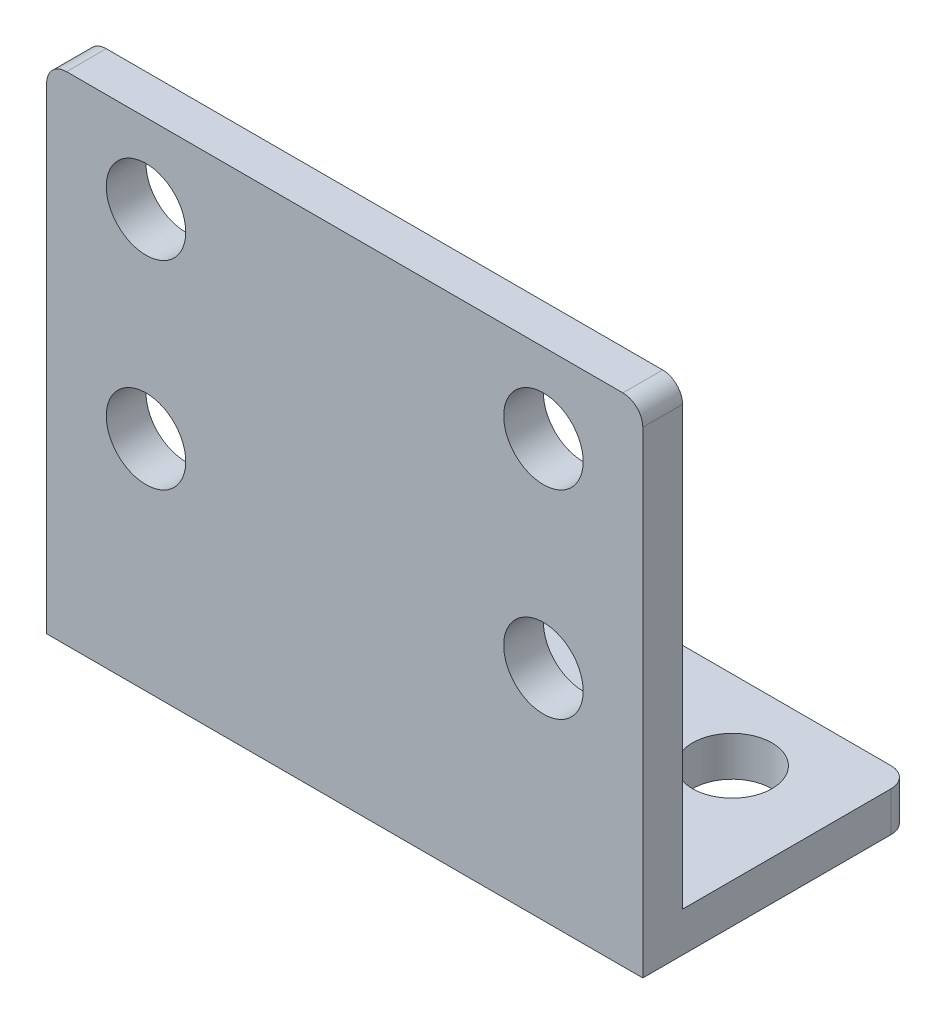
ISO-10303-21;
HEADER;
FILE_DESCRIPTION(('STEP AP214'),'2;1');
FILE_NAME('part.step','',(''),(''),'','','');
FILE_SCHEMA(('AUTOMOTIVE_DESIGN { 1 0 10303 214 1 1 1 1 }'));
ENDSEC;
DATA;
#1=APPLICATION_CONTEXT('core data for automotive mechanical design processes');
#2=APPLICATION_PROTOCOL_DEFINITION('international standard','automotive_design',2000,#1);
#3=PRODUCT_CONTEXT('',#1,'mechanical');
#4=PRODUCT('Part','Part','',(#3));
#5=PRODUCT_RELATED_PRODUCT_CATEGORY('part','',(#4));
#6=PRODUCT_DEFINITION_FORMATION('','',#4);
#7=PRODUCT_DEFINITION_CONTEXT('part definition',#1,'design');
#8=PRODUCT_DEFINITION('design','',#6,#7);
#9=PRODUCT_DEFINITION_SHAPE('','',#8);
#10=(LENGTH_UNIT() NAMED_UNIT(*) SI_UNIT(.MILLI.,.METRE.));
#11=(NAMED_UNIT(*) PLANE_ANGLE_UNIT() SI_UNIT($,.RADIAN.));
#12=(NAMED_UNIT(*) SI_UNIT($,.STERADIAN.) SOLID_ANGLE_UNIT());
#13=UNCERTAINTY_MEASURE_WITH_UNIT(LENGTH_MEASURE(1.E-05),#10,'distance_accuracy_value','');
#14=(GEOMETRIC_REPRESENTATION_CONTEXT(3) GLOBAL_UNCERTAINTY_ASSIGNED_CONTEXT((#13)) GLOBAL_UNIT_ASSIGNED_CONTEXT((#10,
#11,#12)) REPRESENTATION_CONTEXT('',''));
#15=CARTESIAN_POINT('',(0.,0.,0.));
#16=DIRECTION('',(0.,0.,1.));
#17=DIRECTION('',(1.,0.,0.));
#18=AXIS2_PLACEMENT_3D('',#15,#16,#17);
#19=CARTESIAN_POINT('',(60.,0.,-27.));
#20=DIRECTION('',(0.,1.,0.));
#21=DIRECTION('',(0.,0.,1.));
#22=AXIS2_PLACEMENT_3D('',#19,#20,#21);
#23=PLANE('',#22);
#24=CARTESIAN_POINT('',(10.,0.,-19.));
#25=DIRECTION('',(0.,-1.,0.));
#26=DIRECTION('',(0.,0.,-1.));
#27=AXIS2_PLACEMENT_3D('',#24,#25,#26);
#28=CIRCLE('',#27,4.00000000294392);
#29=CARTESIAN_POINT('',(10.,0.,-23.0000000029439));
#30=VERTEX_POINT('',#29);
#31=EDGE_CURVE('E238',#30,#30,#28,.T.);
#32=ORIENTED_EDGE('',*,*,#31,.F.);
#33=EDGE_LOOP('',(#32));
#34=FACE_BOUND('',#33,.T.);
#35=CARTESIAN_POINT('',(50.,0.,-19.));
#36=DIRECTION('',(0.,-1.,0.));
#37=DIRECTION('',(0.,0.,-1.));
#38=AXIS2_PLACEMENT_3D('',#35,#36,#37);
#39=CIRCLE('',#38,4.00000000294394);
#40=CARTESIAN_POINT('',(50.,0.,-23.0000000029439));
#41=VERTEX_POINT('',#40);
#42=EDGE_CURVE('E232',#41,#41,#39,.T.);
#43=ORIENTED_EDGE('',*,*,#42,.F.);
#44=EDGE_LOOP('',(#43));
#45=FACE_BOUND('',#44,.T.);
#46=DIRECTION('',(-1.,0.,0.));
#47=VECTOR('',#46,1.);
#48=CARTESIAN_POINT('',(60.,0.,-27.));
#49=LINE('',#48,#47);
#50=CARTESIAN_POINT('',(58.,0.,-27.));
#51=VERTEX_POINT('',#50);
#52=CARTESIAN_POINT('',(2.,0.,-27.));
#53=VERTEX_POINT('',#52);
#54=EDGE_CURVE('E160',#51,#53,#49,.T.);
#55=ORIENTED_EDGE('',*,*,#54,.F.);
#56=CARTESIAN_POINT('',(58.,0.,-25.));
#57=DIRECTION('',(0.,1.,0.));
#58=DIRECTION('',(0.,0.,1.));
#59=AXIS2_PLACEMENT_3D('',#56,#57,#58);
#60=CIRCLE('',#59,2.);
#61=CARTESIAN_POINT('',(60.,0.,-25.));
#62=VERTEX_POINT('',#61);
#63=EDGE_CURVE('E177',#51,#62,#60,.F.);
#64=ORIENTED_EDGE('',*,*,#63,.T.);
#65=DIRECTION('',(0.,0.,-1.));
#66=VECTOR('',#65,1.);
#67=CARTESIAN_POINT('',(60.,0.,-27.));
#68=LINE('',#67,#66);
#69=CARTESIAN_POINT('',(60.,0.,0.));
#70=VERTEX_POINT('',#69);
#71=EDGE_CURVE('E124',#70,#62,#68,.T.);
#72=ORIENTED_EDGE('',*,*,#71,.F.);
#73=DIRECTION('',(-1.,0.,0.));
#74=VECTOR('',#73,1.);
#75=CARTESIAN_POINT('',(60.,0.,0.));
#76=LINE('',#75,#74);
#77=CARTESIAN_POINT('',(0.,0.,0.));
#78=VERTEX_POINT('',#77);
#79=EDGE_CURVE('E139',#70,#78,#76,.T.);
#80=ORIENTED_EDGE('',*,*,#79,.T.);
#81=DIRECTION('',(0.,0.,-1.));
#82=VECTOR('',#81,1.);
#83=CARTESIAN_POINT('',(0.,0.,-27.));
#84=LINE('',#83,#82);
#85=CARTESIAN_POINT('',(0.,0.,-25.));
#86=VERTEX_POINT('',#85);
#87=EDGE_CURVE('E143',#78,#86,#84,.T.);
#88=ORIENTED_EDGE('',*,*,#87,.T.);
#89=CARTESIAN_POINT('',(2.,0.,-25.));
#90=DIRECTION('',(0.,1.,0.));
#91=DIRECTION('',(0.,0.,1.));
#92=AXIS2_PLACEMENT_3D('',#89,#90,#91);
#93=CIRCLE('',#92,2.);
#94=EDGE_CURVE('E175',#86,#53,#93,.F.);
#95=ORIENTED_EDGE('',*,*,#94,.T.);
#96=EDGE_LOOP('',(#55,#64,#72,#80,#88,#95));
#97=FACE_BOUND('',#96,.T.);
#98=ADVANCED_FACE('F35',(#34,#45,#97),#23,.F.);
#99=CARTESIAN_POINT('',(60.,4.,-27.));
#100=DIRECTION('',(0.,0.,1.));
#101=DIRECTION('',(1.,0.,0.));
#102=AXIS2_PLACEMENT_3D('',#99,#100,#101);
#103=PLANE('',#102);
#104=DIRECTION('',(-1.,0.,0.));
#105=VECTOR('',#104,1.);
#106=CARTESIAN_POINT('',(60.,4.,-27.));
#107=LINE('',#106,#105);
#108=CARTESIAN_POINT('',(58.,4.,-27.));
#109=VERTEX_POINT('',#108);
#110=CARTESIAN_POINT('',(2.,4.,-27.));
#111=VERTEX_POINT('',#110);
#112=EDGE_CURVE('E132',#109,#111,#107,.T.);
#113=ORIENTED_EDGE('',*,*,#112,.F.);
#114=DIRECTION('',(0.,1.,0.));
#115=VECTOR('',#114,1.);
#116=CARTESIAN_POINT('',(58.,4.,-27.));
#117=LINE('',#116,#115);
#118=EDGE_CURVE('E173',#109,#51,#117,.F.);
#119=ORIENTED_EDGE('',*,*,#118,.T.);
#120=ORIENTED_EDGE('',*,*,#54,.T.);
#121=DIRECTION('',(0.,1.,0.));
#122=VECTOR('',#121,1.);
#123=CARTESIAN_POINT('',(2.,4.,-27.));
#124=LINE('',#123,#122);
#125=EDGE_CURVE('E170',#53,#111,#124,.T.);
#126=ORIENTED_EDGE('',*,*,#125,.T.);
#127=EDGE_LOOP('',(#113,#119,#120,#126));
#128=FACE_BOUND('',#127,.T.);
#129=ADVANCED_FACE('F247',(#128),#103,.F.);
#130=CARTESIAN_POINT('',(60.,4.,-4.00000000000001));
#131=DIRECTION('',(0.,-1.,0.));
#132=DIRECTION('',(0.,0.,-1.));
#133=AXIS2_PLACEMENT_3D('',#130,#131,#132);
#134=PLANE('',#133);
#135=CARTESIAN_POINT('',(10.,4.,-19.));
#136=DIRECTION('',(0.,-1.,0.));
#137=DIRECTION('',(0.,0.,-1.));
#138=AXIS2_PLACEMENT_3D('',#135,#136,#137);
#139=CIRCLE('',#138,4.00000000294392);
#140=CARTESIAN_POINT('',(10.,4.,-23.0000000029439));
#141=VERTEX_POINT('',#140);
#142=EDGE_CURVE('E235',#141,#141,#139,.F.);
#143=ORIENTED_EDGE('',*,*,#142,.F.);
#144=EDGE_LOOP('',(#143));
#145=FACE_BOUND('',#144,.T.);
#146=CARTESIAN_POINT('',(50.,4.,-19.));
#147=DIRECTION('',(0.,-1.,0.));
#148=DIRECTION('',(0.,0.,-1.));
#149=AXIS2_PLACEMENT_3D('',#146,#147,#148);
#150=CIRCLE('',#149,4.00000000294394);
#151=CARTESIAN_POINT('',(50.,4.,-23.0000000029439));
#152=VERTEX_POINT('',#151);
#153=EDGE_CURVE('E219',#152,#152,#150,.F.);
#154=ORIENTED_EDGE('',*,*,#153,.F.);
#155=EDGE_LOOP('',(#154));
#156=FACE_BOUND('',#155,.T.);
#157=DIRECTION('',(0.,0.,1.));
#158=VECTOR('',#157,1.);
#159=CARTESIAN_POINT('',(60.,4.,-4.00000000000001));
#160=LINE('',#159,#158);
#161=CARTESIAN_POINT('',(60.,4.,-25.));
#162=VERTEX_POINT('',#161);
#163=CARTESIAN_POINT('',(60.,4.,-4.00000000000001));
#164=VERTEX_POINT('',#163);
#165=EDGE_CURVE('E113',#162,#164,#160,.T.);
#166=ORIENTED_EDGE('',*,*,#165,.F.);
#167=CARTESIAN_POINT('',(58.,4.,-25.));
#168=DIRECTION('',(0.,-1.,0.));
#169=DIRECTION('',(0.,0.,-1.));
#170=AXIS2_PLACEMENT_3D('',#167,#168,#169);
#171=CIRCLE('',#170,2.);
#172=EDGE_CURVE('E168',#162,#109,#171,.F.);
#173=ORIENTED_EDGE('',*,*,#172,.T.);
#174=ORIENTED_EDGE('',*,*,#112,.T.);
#175=CARTESIAN_POINT('',(2.,4.,-25.));
#176=DIRECTION('',(0.,-1.,0.));
#177=DIRECTION('',(0.,0.,-1.));
#178=AXIS2_PLACEMENT_3D('',#175,#176,#177);
#179=CIRCLE('',#178,2.);
#180=CARTESIAN_POINT('',(0.,4.,-25.));
#181=VERTEX_POINT('',#180);
#182=EDGE_CURVE('E166',#111,#181,#179,.F.);
#183=ORIENTED_EDGE('',*,*,#182,.T.);
#184=DIRECTION('',(0.,0.,1.));
#185=VECTOR('',#184,1.);
#186=CARTESIAN_POINT('',(0.,4.,-4.00000000000001));
#187=LINE('',#186,#185);
#188=CARTESIAN_POINT('',(0.,4.,-4.00000000000001));
#189=VERTEX_POINT('',#188);
#190=EDGE_CURVE('E130',#181,#189,#187,.T.);
#191=ORIENTED_EDGE('',*,*,#190,.T.);
#192=DIRECTION('',(-1.,0.,0.));
#193=VECTOR('',#192,1.);
#194=CARTESIAN_POINT('',(60.,4.,-4.00000000000001));
#195=LINE('',#194,#193);
#196=EDGE_CURVE('E127',#164,#189,#195,.T.);
#197=ORIENTED_EDGE('',*,*,#196,.F.);
#198=EDGE_LOOP('',(#166,#173,#174,#183,#191,#197));
#199=FACE_BOUND('',#198,.T.);
#200=ADVANCED_FACE('F128',(#145,#156,#199),#134,.F.);
#201=CARTESIAN_POINT('',(60.,50.,-4.));
#202=DIRECTION('',(0.,0.,1.));
#203=DIRECTION('',(0.,-1.,0.));
#204=AXIS2_PLACEMENT_3D('',#201,#202,#203);
#205=PLANE('',#204);
#206=CARTESIAN_POINT('',(50.,22.,-4.));
#207=DIRECTION('',(0.,0.,1.));
#208=DIRECTION('',(0.,-1.,0.));
#209=AXIS2_PLACEMENT_3D('',#206,#207,#208);
#210=CIRCLE('',#209,3.99999999629061);
#211=CARTESIAN_POINT('',(50.,18.0000000037094,-4.));
#212=VERTEX_POINT('',#211);
#213=EDGE_CURVE('E211',#212,#212,#210,.F.);
#214=ORIENTED_EDGE('',*,*,#213,.F.);
#215=EDGE_LOOP('',(#214));
#216=FACE_BOUND('',#215,.T.);
#217=CARTESIAN_POINT('',(50.,42.,-4.));
#218=DIRECTION('',(0.,0.,1.));
#219=DIRECTION('',(0.,-1.,0.));
#220=AXIS2_PLACEMENT_3D('',#217,#218,#219);
#221=CIRCLE('',#220,3.9999999962906);
#222=CARTESIAN_POINT('',(50.,38.0000000037094,-4.));
#223=VERTEX_POINT('',#222);
#224=EDGE_CURVE('E220',#223,#223,#221,.F.);
#225=ORIENTED_EDGE('',*,*,#224,.F.);
#226=EDGE_LOOP('',(#225));
#227=FACE_BOUND('',#226,.T.);
#228=CARTESIAN_POINT('',(10.,42.,-4.));
#229=DIRECTION('',(0.,0.,1.));
#230=DIRECTION('',(0.,-1.,0.));
#231=AXIS2_PLACEMENT_3D('',#228,#229,#230);
#232=CIRCLE('',#231,3.9999999962906);
#233=CARTESIAN_POINT('',(10.,38.0000000037094,-4.));
#234=VERTEX_POINT('',#233);
#235=EDGE_CURVE('E212',#234,#234,#232,.F.);
#236=ORIENTED_EDGE('',*,*,#235,.F.);
#237=EDGE_LOOP('',(#236));
#238=FACE_BOUND('',#237,.T.);
#239=CARTESIAN_POINT('',(10.,22.,-4.));
#240=DIRECTION('',(0.,0.,1.));
#241=DIRECTION('',(0.,-1.,0.));
#242=AXIS2_PLACEMENT_3D('',#239,#240,#241);
#243=CIRCLE('',#242,3.99999999629061);
#244=CARTESIAN_POINT('',(10.,18.0000000037094,-4.));
#245=VERTEX_POINT('',#244);
#246=EDGE_CURVE('E146',#245,#245,#243,.F.);
#247=ORIENTED_EDGE('',*,*,#246,.F.);
#248=EDGE_LOOP('',(#247));
#249=FACE_BOUND('',#248,.T.);
#250=DIRECTION('',(-1.,0.,0.));
#251=VECTOR('',#250,1.);
#252=CARTESIAN_POINT('',(60.,50.,-4.));
#253=LINE('',#252,#251);
#254=CARTESIAN_POINT('',(58.,50.,-4.));
#255=VERTEX_POINT('',#254);
#256=CARTESIAN_POINT('',(2.,50.,-4.));
#257=VERTEX_POINT('',#256);
#258=EDGE_CURVE('E133',#255,#257,#253,.T.);
#259=ORIENTED_EDGE('',*,*,#258,.F.);
#260=CARTESIAN_POINT('',(58.,48.,-4.));
#261=DIRECTION('',(0.,0.,1.));
#262=DIRECTION('',(0.,-1.,0.));
#263=AXIS2_PLACEMENT_3D('',#260,#261,#262);
#264=CIRCLE('',#263,2.);
#265=CARTESIAN_POINT('',(60.,48.,-4.));
#266=VERTEX_POINT('',#265);
#267=EDGE_CURVE('E11',#255,#266,#264,.F.);
#268=ORIENTED_EDGE('',*,*,#267,.T.);
#269=DIRECTION('',(0.,1.,0.));
#270=VECTOR('',#269,1.);
#271=CARTESIAN_POINT('',(60.,50.,-4.));
#272=LINE('',#271,#270);
#273=EDGE_CURVE('E119',#164,#266,#272,.T.);
#274=ORIENTED_EDGE('',*,*,#273,.F.);
#275=ORIENTED_EDGE('',*,*,#196,.T.);
#276=DIRECTION('',(0.,1.,0.));
#277=VECTOR('',#276,1.);
#278=CARTESIAN_POINT('',(0.,50.,-4.));
#279=LINE('',#278,#277);
#280=CARTESIAN_POINT('',(0.,48.,-4.));
#281=VERTEX_POINT('',#280);
#282=EDGE_CURVE('E148',#189,#281,#279,.T.);
#283=ORIENTED_EDGE('',*,*,#282,.T.);
#284=CARTESIAN_POINT('',(2.,48.,-4.));
#285=DIRECTION('',(0.,0.,1.));
#286=DIRECTION('',(0.,-1.,0.));
#287=AXIS2_PLACEMENT_3D('',#284,#285,#286);
#288=CIRCLE('',#287,2.);
#289=EDGE_CURVE('E43',#281,#257,#288,.F.);
#290=ORIENTED_EDGE('',*,*,#289,.T.);
#291=EDGE_LOOP('',(#259,#268,#274,#275,#283,#290));
#292=FACE_BOUND('',#291,.T.);
#293=ADVANCED_FACE('F135',(#216,#227,#238,#249,#292),#205,.F.);
#294=CARTESIAN_POINT('',(60.,50.,0.));
#295=DIRECTION('',(0.,-1.,0.));
#296=DIRECTION('',(0.,0.,-1.));
#297=AXIS2_PLACEMENT_3D('',#294,#295,#296);
#298=PLANE('',#297);
#299=DIRECTION('',(-1.,0.,0.));
#300=VECTOR('',#299,1.);
#301=CARTESIAN_POINT('',(60.,50.,0.));
#302=LINE('',#301,#300);
#303=CARTESIAN_POINT('',(58.,50.,0.));
#304=VERTEX_POINT('',#303);
#305=CARTESIAN_POINT('',(2.,50.,0.));
#306=VERTEX_POINT('',#305);
#307=EDGE_CURVE('E154',#304,#306,#302,.T.);
#308=ORIENTED_EDGE('',*,*,#307,.F.);
#309=DIRECTION('',(0.,0.,1.));
#310=VECTOR('',#309,1.);
#311=CARTESIAN_POINT('',(58.,50.,0.));
#312=LINE('',#311,#310);
#313=EDGE_CURVE('E56',#304,#255,#312,.F.);
#314=ORIENTED_EDGE('',*,*,#313,.T.);
#315=ORIENTED_EDGE('',*,*,#258,.T.);
#316=DIRECTION('',(0.,0.,1.));
#317=VECTOR('',#316,1.);
#318=CARTESIAN_POINT('',(2.,50.,0.));
#319=LINE('',#318,#317);
#320=EDGE_CURVE('E187',#257,#306,#319,.T.);
#321=ORIENTED_EDGE('',*,*,#320,.T.);
#322=EDGE_LOOP('',(#308,#314,#315,#321));
#323=FACE_BOUND('',#322,.T.);
#324=ADVANCED_FACE('F191',(#323),#298,.F.);
#325=CARTESIAN_POINT('',(60.,0.,0.));
#326=DIRECTION('',(0.,0.,-1.));
#327=DIRECTION('',(-1.,0.,0.));
#328=AXIS2_PLACEMENT_3D('',#325,#326,#327);
#329=PLANE('',#328);
#330=CARTESIAN_POINT('',(50.,22.,0.));
#331=DIRECTION('',(0.,0.,1.));
#332=DIRECTION('',(1.,0.,0.));
#333=AXIS2_PLACEMENT_3D('',#330,#331,#332);
#334=CIRCLE('',#333,3.99999999629061);
#335=CARTESIAN_POINT('',(53.9999999962906,22.,0.));
#336=VERTEX_POINT('',#335);
#337=EDGE_CURVE('E223',#336,#336,#334,.T.);
#338=ORIENTED_EDGE('',*,*,#337,.F.);
#339=EDGE_LOOP('',(#338));
#340=FACE_BOUND('',#339,.T.);
#341=CARTESIAN_POINT('',(50.,42.,0.));
#342=DIRECTION('',(0.,0.,1.));
#343=DIRECTION('',(1.,0.,0.));
#344=AXIS2_PLACEMENT_3D('',#341,#342,#343);
#345=CIRCLE('',#344,3.9999999962906);
#346=CARTESIAN_POINT('',(53.9999999962906,42.,0.));
#347=VERTEX_POINT('',#346);
#348=EDGE_CURVE('E215',#347,#347,#345,.T.);
#349=ORIENTED_EDGE('',*,*,#348,.F.);
#350=EDGE_LOOP('',(#349));
#351=FACE_BOUND('',#350,.T.);
#352=CARTESIAN_POINT('',(10.,42.,0.));
#353=DIRECTION('',(0.,0.,1.));
#354=DIRECTION('',(1.,0.,0.));
#355=AXIS2_PLACEMENT_3D('',#352,#353,#354);
#356=CIRCLE('',#355,3.9999999962906);
#357=CARTESIAN_POINT('',(13.9999999962906,42.,0.));
#358=VERTEX_POINT('',#357);
#359=EDGE_CURVE('E216',#358,#358,#356,.T.);
#360=ORIENTED_EDGE('',*,*,#359,.F.);
#361=EDGE_LOOP('',(#360));
#362=FACE_BOUND('',#361,.T.);
#363=CARTESIAN_POINT('',(10.,22.,0.));
#364=DIRECTION('',(0.,0.,1.));
#365=DIRECTION('',(1.,0.,0.));
#366=AXIS2_PLACEMENT_3D('',#363,#364,#365);
#367=CIRCLE('',#366,3.99999999629061);
#368=CARTESIAN_POINT('',(13.9999999962906,22.,0.));
#369=VERTEX_POINT('',#368);
#370=EDGE_CURVE('E208',#369,#369,#367,.T.);
#371=ORIENTED_EDGE('',*,*,#370,.F.);
#372=EDGE_LOOP('',(#371));
#373=FACE_BOUND('',#372,.T.);
#374=DIRECTION('',(0.,-1.,0.));
#375=VECTOR('',#374,1.);
#376=CARTESIAN_POINT('',(60.,0.,0.));
#377=LINE('',#376,#375);
#378=CARTESIAN_POINT('',(60.,48.,0.));
#379=VERTEX_POINT('',#378);
#380=EDGE_CURVE('E137',#379,#70,#377,.T.);
#381=ORIENTED_EDGE('',*,*,#380,.F.);
#382=CARTESIAN_POINT('',(58.,48.,0.));
#383=DIRECTION('',(0.,0.,-1.));
#384=DIRECTION('',(-1.,0.,0.));
#385=AXIS2_PLACEMENT_3D('',#382,#383,#384);
#386=CIRCLE('',#385,2.);
#387=EDGE_CURVE('E185',#379,#304,#386,.F.);
#388=ORIENTED_EDGE('',*,*,#387,.T.);
#389=ORIENTED_EDGE('',*,*,#307,.T.);
#390=CARTESIAN_POINT('',(2.,48.,0.));
#391=DIRECTION('',(0.,0.,-1.));
#392=DIRECTION('',(-1.,0.,0.));
#393=AXIS2_PLACEMENT_3D('',#390,#391,#392);
#394=CIRCLE('',#393,2.);
#395=CARTESIAN_POINT('',(0.,48.,0.));
#396=VERTEX_POINT('',#395);
#397=EDGE_CURVE('E183',#306,#396,#394,.F.);
#398=ORIENTED_EDGE('',*,*,#397,.T.);
#399=DIRECTION('',(0.,-1.,0.));
#400=VECTOR('',#399,1.);
#401=CARTESIAN_POINT('',(0.,0.,0.));
#402=LINE('',#401,#400);
#403=EDGE_CURVE('E150',#396,#78,#402,.T.);
#404=ORIENTED_EDGE('',*,*,#403,.T.);
#405=ORIENTED_EDGE('',*,*,#79,.F.);
#406=EDGE_LOOP('',(#381,#388,#389,#398,#404,#405));
#407=FACE_BOUND('',#406,.T.);
#408=ADVANCED_FACE('F195',(#340,#351,#362,#373,#407),#329,.F.);
#409=CARTESIAN_POINT('',(60.,0.,0.));
#410=DIRECTION('',(-1.,0.,0.));
#411=DIRECTION('',(0.,0.,1.));
#412=AXIS2_PLACEMENT_3D('',#409,#410,#411);
#413=PLANE('',#412);
#414=ORIENTED_EDGE('',*,*,#71,.T.);
#415=DIRECTION('',(0.,1.,0.));
#416=VECTOR('',#415,1.);
#417=CARTESIAN_POINT('',(60.,0.,-25.));
#418=LINE('',#417,#416);
#419=EDGE_CURVE('E122',#62,#162,#418,.T.);
#420=ORIENTED_EDGE('',*,*,#419,.T.);
#421=ORIENTED_EDGE('',*,*,#165,.T.);
#422=ORIENTED_EDGE('',*,*,#273,.T.);
#423=DIRECTION('',(0.,0.,1.));
#424=VECTOR('',#423,1.);
#425=CARTESIAN_POINT('',(60.,48.,0.));
#426=LINE('',#425,#424);
#427=EDGE_CURVE('E163',#266,#379,#426,.T.);
#428=ORIENTED_EDGE('',*,*,#427,.T.);
#429=ORIENTED_EDGE('',*,*,#380,.T.);
#430=EDGE_LOOP('',(#414,#420,#421,#422,#428,#429));
#431=FACE_BOUND('',#430,.T.);
#432=ADVANCED_FACE('F116',(#431),#413,.F.);
#433=CARTESIAN_POINT('',(0.,0.,0.));
#434=DIRECTION('',(-1.,0.,0.));
#435=DIRECTION('',(0.,0.,1.));
#436=AXIS2_PLACEMENT_3D('',#433,#434,#435);
#437=PLANE('',#436);
#438=ORIENTED_EDGE('',*,*,#190,.F.);
#439=DIRECTION('',(0.,1.,0.));
#440=VECTOR('',#439,1.);
#441=CARTESIAN_POINT('',(0.,0.,-25.));
#442=LINE('',#441,#440);
#443=EDGE_CURVE('E181',#181,#86,#442,.F.);
#444=ORIENTED_EDGE('',*,*,#443,.T.);
#445=ORIENTED_EDGE('',*,*,#87,.F.);
#446=ORIENTED_EDGE('',*,*,#403,.F.);
#447=DIRECTION('',(0.,0.,1.));
#448=VECTOR('',#447,1.);
#449=CARTESIAN_POINT('',(0.,48.,-4.));
#450=LINE('',#449,#448);
#451=EDGE_CURVE('E179',#396,#281,#450,.F.);
#452=ORIENTED_EDGE('',*,*,#451,.T.);
#453=ORIENTED_EDGE('',*,*,#282,.F.);
#454=EDGE_LOOP('',(#438,#444,#445,#446,#452,#453));
#455=FACE_BOUND('',#454,.T.);
#456=ADVANCED_FACE('F287',(#455),#437,.T.);
#457=CARTESIAN_POINT('',(10.,22.,-27.001));
#458=DIRECTION('',(0.,0.,1.));
#459=DIRECTION('',(1.,0.,0.));
#460=AXIS2_PLACEMENT_3D('',#457,#458,#459);
#461=CYLINDRICAL_SURFACE('',#460,3.99999999629061);
#462=ORIENTED_EDGE('',*,*,#370,.T.);
#463=EDGE_LOOP('',(#462));
#464=FACE_BOUND('',#463,.T.);
#465=ORIENTED_EDGE('',*,*,#246,.T.);
#466=EDGE_LOOP('',(#465));
#467=FACE_BOUND('',#466,.T.);
#468=ADVANCED_FACE('F294',(#464,#467),#461,.F.);
#469=CARTESIAN_POINT('',(10.,42.,-27.001));
#470=DIRECTION('',(0.,0.,1.));
#471=DIRECTION('',(1.,0.,0.));
#472=AXIS2_PLACEMENT_3D('',#469,#470,#471);
#473=CYLINDRICAL_SURFACE('',#472,3.9999999962906);
#474=ORIENTED_EDGE('',*,*,#359,.T.);
#475=EDGE_LOOP('',(#474));
#476=FACE_BOUND('',#475,.T.);
#477=ORIENTED_EDGE('',*,*,#235,.T.);
#478=EDGE_LOOP('',(#477));
#479=FACE_BOUND('',#478,.T.);
#480=ADVANCED_FACE('F300',(#476,#479),#473,.F.);
#481=CARTESIAN_POINT('',(50.,42.,-27.001));
#482=DIRECTION('',(0.,0.,1.));
#483=DIRECTION('',(1.,0.,0.));
#484=AXIS2_PLACEMENT_3D('',#481,#482,#483);
#485=CYLINDRICAL_SURFACE('',#484,3.9999999962906);
#486=ORIENTED_EDGE('',*,*,#348,.T.);
#487=EDGE_LOOP('',(#486));
#488=FACE_BOUND('',#487,.T.);
#489=ORIENTED_EDGE('',*,*,#224,.T.);
#490=EDGE_LOOP('',(#489));
#491=FACE_BOUND('',#490,.T.);
#492=ADVANCED_FACE('F364',(#488,#491),#485,.F.);
#493=CARTESIAN_POINT('',(50.,22.,-27.001));
#494=DIRECTION('',(0.,0.,1.));
#495=DIRECTION('',(1.,0.,0.));
#496=AXIS2_PLACEMENT_3D('',#493,#494,#495);
#497=CYLINDRICAL_SURFACE('',#496,3.99999999629061);
#498=ORIENTED_EDGE('',*,*,#337,.T.);
#499=EDGE_LOOP('',(#498));
#500=FACE_BOUND('',#499,.T.);
#501=ORIENTED_EDGE('',*,*,#213,.T.);
#502=EDGE_LOOP('',(#501));
#503=FACE_BOUND('',#502,.T.);
#504=ADVANCED_FACE('F254',(#500,#503),#497,.F.);
#505=CARTESIAN_POINT('',(50.,50.001,-19.));
#506=DIRECTION('',(0.,-1.,0.));
#507=DIRECTION('',(0.,0.,-1.));
#508=AXIS2_PLACEMENT_3D('',#505,#506,#507);
#509=CYLINDRICAL_SURFACE('',#508,4.00000000294394);
#510=ORIENTED_EDGE('',*,*,#42,.T.);
#511=EDGE_LOOP('',(#510));
#512=FACE_BOUND('',#511,.T.);
#513=ORIENTED_EDGE('',*,*,#153,.T.);
#514=EDGE_LOOP('',(#513));
#515=FACE_BOUND('',#514,.T.);
#516=ADVANCED_FACE('F251',(#512,#515),#509,.F.);
#517=CARTESIAN_POINT('',(10.,50.001,-19.));
#518=DIRECTION('',(0.,-1.,0.));
#519=DIRECTION('',(0.,0.,-1.));
#520=AXIS2_PLACEMENT_3D('',#517,#518,#519);
#521=CYLINDRICAL_SURFACE('',#520,4.00000000294392);
#522=ORIENTED_EDGE('',*,*,#31,.T.);
#523=EDGE_LOOP('',(#522));
#524=FACE_BOUND('',#523,.T.);
#525=ORIENTED_EDGE('',*,*,#142,.T.);
#526=EDGE_LOOP('',(#525));
#527=FACE_BOUND('',#526,.T.);
#528=ADVANCED_FACE('F242',(#524,#527),#521,.F.);
#529=CARTESIAN_POINT('',(58.,0.,-25.));
#530=DIRECTION('',(0.,1.,0.));
#531=DIRECTION('',(0.,0.,1.));
#532=AXIS2_PLACEMENT_3D('',#529,#530,#531);
#533=CYLINDRICAL_SURFACE('',#532,2.);
#534=ORIENTED_EDGE('',*,*,#63,.F.);
#535=ORIENTED_EDGE('',*,*,#118,.F.);
#536=ORIENTED_EDGE('',*,*,#172,.F.);
#537=ORIENTED_EDGE('',*,*,#419,.F.);
#538=EDGE_LOOP('',(#534,#535,#536,#537));
#539=FACE_BOUND('',#538,.T.);
#540=ADVANCED_FACE('F272',(#539),#533,.T.);
#541=CARTESIAN_POINT('',(2.,4.,-25.));
#542=DIRECTION('',(0.,-1.,0.));
#543=DIRECTION('',(0.,0.,-1.));
#544=AXIS2_PLACEMENT_3D('',#541,#542,#543);
#545=CYLINDRICAL_SURFACE('',#544,2.);
#546=ORIENTED_EDGE('',*,*,#94,.F.);
#547=ORIENTED_EDGE('',*,*,#443,.F.);
#548=ORIENTED_EDGE('',*,*,#182,.F.);
#549=ORIENTED_EDGE('',*,*,#125,.F.);
#550=EDGE_LOOP('',(#546,#547,#548,#549));
#551=FACE_BOUND('',#550,.T.);
#552=ADVANCED_FACE('F275',(#551),#545,.T.);
#553=CARTESIAN_POINT('',(58.,48.,0.));
#554=DIRECTION('',(0.,0.,1.));
#555=DIRECTION('',(1.,0.,0.));
#556=AXIS2_PLACEMENT_3D('',#553,#554,#555);
#557=CYLINDRICAL_SURFACE('',#556,2.);
#558=ORIENTED_EDGE('',*,*,#267,.F.);
#559=ORIENTED_EDGE('',*,*,#313,.F.);
#560=ORIENTED_EDGE('',*,*,#387,.F.);
#561=ORIENTED_EDGE('',*,*,#427,.F.);
#562=EDGE_LOOP('',(#558,#559,#560,#561));
#563=FACE_BOUND('',#562,.T.);
#564=ADVANCED_FACE('F199',(#563),#557,.T.);
#565=CARTESIAN_POINT('',(2.,48.,0.));
#566=DIRECTION('',(0.,0.,-1.));
#567=DIRECTION('',(-1.,0.,0.));
#568=AXIS2_PLACEMENT_3D('',#565,#566,#567);
#569=CYLINDRICAL_SURFACE('',#568,2.);
#570=ORIENTED_EDGE('',*,*,#289,.F.);
#571=ORIENTED_EDGE('',*,*,#451,.F.);
#572=ORIENTED_EDGE('',*,*,#397,.F.);
#573=ORIENTED_EDGE('',*,*,#320,.F.);
#574=EDGE_LOOP('',(#570,#571,#572,#573));
#575=FACE_BOUND('',#574,.T.);
#576=ADVANCED_FACE('F37',(#575),#569,.T.);
#577=CLOSED_SHELL('',(#98,#129,#200,#293,#324,#408,#432,#456,#468,#480,#492,#504,#516,#528,#540,
#552,#564,#576));
#578=MANIFOLD_SOLID_BREP('B2',#577);
#579=ADVANCED_BREP_SHAPE_REPRESENTATION('',(#18,#578),#14);
#580=SHAPE_DEFINITION_REPRESENTATION(#9,#579);
ENDSEC;
END-ISO-10303-21;
